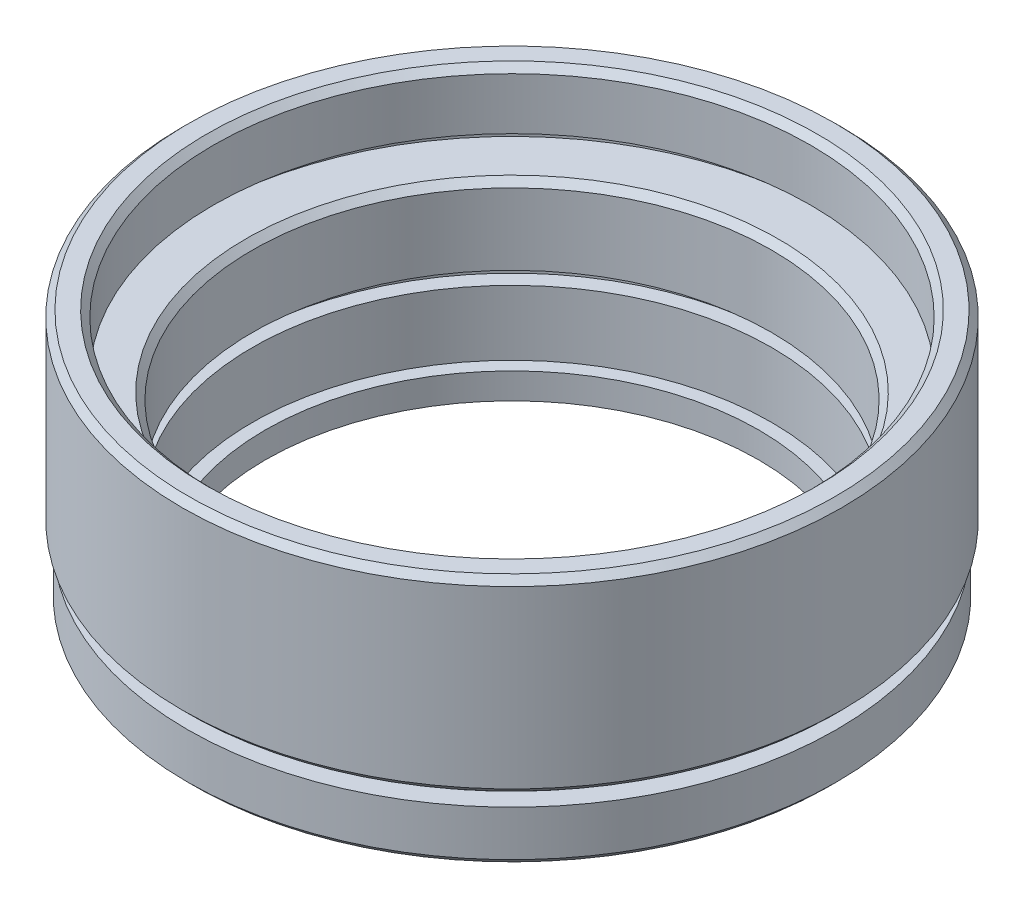
ISO-10303-21;
HEADER;
FILE_DESCRIPTION(('STEP AP214'),'2;1');
FILE_NAME('part.step','',(''),(''),'','','');
FILE_SCHEMA(('AUTOMOTIVE_DESIGN { 1 0 10303 214 1 1 1 1 }'));
ENDSEC;
DATA;
#1=APPLICATION_CONTEXT('core data for automotive mechanical design processes');
#2=APPLICATION_PROTOCOL_DEFINITION('international standard','automotive_design',2000,#1);
#3=PRODUCT_CONTEXT('',#1,'mechanical');
#4=PRODUCT('Part','Part','',(#3));
#5=PRODUCT_RELATED_PRODUCT_CATEGORY('part','',(#4));
#6=PRODUCT_DEFINITION_FORMATION('','',#4);
#7=PRODUCT_DEFINITION_CONTEXT('part definition',#1,'design');
#8=PRODUCT_DEFINITION('design','',#6,#7);
#9=PRODUCT_DEFINITION_SHAPE('','',#8);
#10=(LENGTH_UNIT() NAMED_UNIT(*) SI_UNIT(.MILLI.,.METRE.));
#11=(NAMED_UNIT(*) PLANE_ANGLE_UNIT() SI_UNIT($,.RADIAN.));
#12=(NAMED_UNIT(*) SI_UNIT($,.STERADIAN.) SOLID_ANGLE_UNIT());
#13=UNCERTAINTY_MEASURE_WITH_UNIT(LENGTH_MEASURE(1.E-05),#10,'distance_accuracy_value','');
#14=(GEOMETRIC_REPRESENTATION_CONTEXT(3) GLOBAL_UNCERTAINTY_ASSIGNED_CONTEXT((#13)) GLOBAL_UNIT_ASSIGNED_CONTEXT((#10,
#11,#12)) REPRESENTATION_CONTEXT('',''));
#15=CARTESIAN_POINT('',(0.,0.,0.));
#16=DIRECTION('',(0.,0.,1.));
#17=DIRECTION('',(1.,0.,0.));
#18=AXIS2_PLACEMENT_3D('',#15,#16,#17);
#19=CARTESIAN_POINT('',(23.,19.5,0.));
#20=DIRECTION('',(0.,1.,0.));
#21=DIRECTION('',(0.,0.,1.));
#22=AXIS2_PLACEMENT_3D('',#19,#20,#21);
#23=PLANE('',#22);
#24=CARTESIAN_POINT('',(0.,19.5,0.));
#25=DIRECTION('',(0.,1.,0.));
#26=DIRECTION('',(0.,0.,1.));
#27=AXIS2_PLACEMENT_3D('',#24,#25,#26);
#28=CIRCLE('',#27,23.5);
#29=CARTESIAN_POINT('',(0.,19.5,23.5));
#30=VERTEX_POINT('',#29);
#31=EDGE_CURVE('E40',#30,#30,#28,.F.);
#32=ORIENTED_EDGE('',*,*,#31,.T.);
#33=EDGE_LOOP('',(#32));
#34=FACE_BOUND('',#33,.T.);
#35=CARTESIAN_POINT('',(0.,19.5,0.));
#36=DIRECTION('',(0.,-1.,0.));
#37=DIRECTION('',(0.,0.,-1.));
#38=AXIS2_PLACEMENT_3D('',#35,#36,#37);
#39=CIRCLE('',#38,24.9);
#40=CARTESIAN_POINT('',(0.,19.5,-24.9));
#41=VERTEX_POINT('',#40);
#42=EDGE_CURVE('E107',#41,#41,#39,.T.);
#43=ORIENTED_EDGE('',*,*,#42,.F.);
#44=EDGE_LOOP('',(#43));
#45=FACE_BOUND('',#44,.T.);
#46=ADVANCED_FACE('F33',(#34,#45),#23,.T.);
#47=CARTESIAN_POINT('',(0.,0.,0.));
#48=DIRECTION('',(0.,-1.,0.));
#49=DIRECTION('',(0.,0.,-1.));
#50=AXIS2_PLACEMENT_3D('',#47,#48,#49);
#51=CYLINDRICAL_SURFACE('',#50,23.);
#52=CARTESIAN_POINT('',(0.,19.,0.));
#53=DIRECTION('',(0.,1.,0.));
#54=DIRECTION('',(0.,0.,1.));
#55=AXIS2_PLACEMENT_3D('',#52,#53,#54);
#56=CIRCLE('',#55,23.);
#57=CARTESIAN_POINT('',(0.,19.,23.));
#58=VERTEX_POINT('',#57);
#59=EDGE_CURVE('E10',#58,#58,#56,.T.);
#60=ORIENTED_EDGE('',*,*,#59,.T.);
#61=EDGE_LOOP('',(#60));
#62=FACE_BOUND('',#61,.T.);
#63=CARTESIAN_POINT('',(0.,15.,0.));
#64=DIRECTION('',(0.,-1.,0.));
#65=DIRECTION('',(0.,0.,-1.));
#66=AXIS2_PLACEMENT_3D('',#63,#64,#65);
#67=CIRCLE('',#66,23.);
#68=CARTESIAN_POINT('',(0.,15.,-23.));
#69=VERTEX_POINT('',#68);
#70=EDGE_CURVE('E53',#69,#69,#67,.T.);
#71=ORIENTED_EDGE('',*,*,#70,.T.);
#72=EDGE_LOOP('',(#71));
#73=FACE_BOUND('',#72,.T.);
#74=ADVANCED_FACE('F115',(#62,#73),#51,.F.);
#75=CARTESIAN_POINT('',(24.15,15.,0.));
#76=DIRECTION('',(0.,-1.,0.));
#77=DIRECTION('',(0.,0.,-1.));
#78=AXIS2_PLACEMENT_3D('',#75,#76,#77);
#79=PLANE('',#78);
#80=CARTESIAN_POINT('',(0.,15.,0.));
#81=DIRECTION('',(0.,-1.,0.));
#82=DIRECTION('',(0.,0.,-1.));
#83=AXIS2_PLACEMENT_3D('',#80,#81,#82);
#84=CIRCLE('',#83,24.15);
#85=CARTESIAN_POINT('',(0.,15.,-24.15));
#86=VERTEX_POINT('',#85);
#87=EDGE_CURVE('E56',#86,#86,#84,.T.);
#88=ORIENTED_EDGE('',*,*,#87,.T.);
#89=EDGE_LOOP('',(#88));
#90=FACE_BOUND('',#89,.T.);
#91=ORIENTED_EDGE('',*,*,#70,.F.);
#92=EDGE_LOOP('',(#91));
#93=FACE_BOUND('',#92,.T.);
#94=ADVANCED_FACE('F120',(#90,#93),#79,.T.);
#95=CARTESIAN_POINT('',(0.,0.,0.));
#96=DIRECTION('',(0.,-1.,0.));
#97=DIRECTION('',(0.,0.,-1.));
#98=AXIS2_PLACEMENT_3D('',#95,#96,#97);
#99=CYLINDRICAL_SURFACE('',#98,24.15);
#100=CARTESIAN_POINT('',(0.,14.,0.));
#101=DIRECTION('',(0.,-1.,0.));
#102=DIRECTION('',(0.,0.,-1.));
#103=AXIS2_PLACEMENT_3D('',#100,#101,#102);
#104=CIRCLE('',#103,24.15);
#105=CARTESIAN_POINT('',(0.,14.,-24.15));
#106=VERTEX_POINT('',#105);
#107=EDGE_CURVE('E59',#106,#106,#104,.T.);
#108=ORIENTED_EDGE('',*,*,#107,.T.);
#109=EDGE_LOOP('',(#108));
#110=FACE_BOUND('',#109,.T.);
#111=ORIENTED_EDGE('',*,*,#87,.F.);
#112=EDGE_LOOP('',(#111));
#113=FACE_BOUND('',#112,.T.);
#114=ADVANCED_FACE('F141',(#110,#113),#99,.F.);
#115=CARTESIAN_POINT('',(20.,14.,0.));
#116=DIRECTION('',(0.,1.,0.));
#117=DIRECTION('',(0.,0.,1.));
#118=AXIS2_PLACEMENT_3D('',#115,#116,#117);
#119=PLANE('',#118);
#120=CARTESIAN_POINT('',(0.,14.,0.));
#121=DIRECTION('',(0.,1.,0.));
#122=DIRECTION('',(0.,0.,1.));
#123=AXIS2_PLACEMENT_3D('',#120,#121,#122);
#124=CIRCLE('',#123,20.5);
#125=CARTESIAN_POINT('',(0.,14.,20.5));
#126=VERTEX_POINT('',#125);
#127=EDGE_CURVE('E48',#126,#126,#124,.F.);
#128=ORIENTED_EDGE('',*,*,#127,.T.);
#129=EDGE_LOOP('',(#128));
#130=FACE_BOUND('',#129,.T.);
#131=ORIENTED_EDGE('',*,*,#107,.F.);
#132=EDGE_LOOP('',(#131));
#133=FACE_BOUND('',#132,.T.);
#134=ADVANCED_FACE('F137',(#130,#133),#119,.T.);
#135=CARTESIAN_POINT('',(0.,0.,0.));
#136=DIRECTION('',(0.,-1.,0.));
#137=DIRECTION('',(0.,0.,-1.));
#138=AXIS2_PLACEMENT_3D('',#135,#136,#137);
#139=CYLINDRICAL_SURFACE('',#138,20.);
#140=CARTESIAN_POINT('',(0.,13.5,0.));
#141=DIRECTION('',(0.,1.,0.));
#142=DIRECTION('',(0.,0.,1.));
#143=AXIS2_PLACEMENT_3D('',#140,#141,#142);
#144=CIRCLE('',#143,20.);
#145=CARTESIAN_POINT('',(0.,13.5,20.));
#146=VERTEX_POINT('',#145);
#147=EDGE_CURVE('E44',#146,#146,#144,.T.);
#148=ORIENTED_EDGE('',*,*,#147,.T.);
#149=EDGE_LOOP('',(#148));
#150=FACE_BOUND('',#149,.T.);
#151=CARTESIAN_POINT('',(0.,8.,0.));
#152=DIRECTION('',(0.,-1.,0.));
#153=DIRECTION('',(0.,0.,-1.));
#154=AXIS2_PLACEMENT_3D('',#151,#152,#153);
#155=CIRCLE('',#154,20.);
#156=CARTESIAN_POINT('',(0.,8.,-20.));
#157=VERTEX_POINT('',#156);
#158=EDGE_CURVE('E62',#157,#157,#155,.T.);
#159=ORIENTED_EDGE('',*,*,#158,.T.);
#160=EDGE_LOOP('',(#159));
#161=FACE_BOUND('',#160,.T.);
#162=ADVANCED_FACE('F140',(#150,#161),#139,.F.);
#163=CARTESIAN_POINT('',(21.15,8.,0.));
#164=DIRECTION('',(0.,-1.,0.));
#165=DIRECTION('',(0.,0.,-1.));
#166=AXIS2_PLACEMENT_3D('',#163,#164,#165);
#167=PLANE('',#166);
#168=CARTESIAN_POINT('',(0.,8.,0.));
#169=DIRECTION('',(0.,-1.,0.));
#170=DIRECTION('',(0.,0.,-1.));
#171=AXIS2_PLACEMENT_3D('',#168,#169,#170);
#172=CIRCLE('',#171,21.15);
#173=CARTESIAN_POINT('',(0.,8.,-21.15));
#174=VERTEX_POINT('',#173);
#175=EDGE_CURVE('E65',#174,#174,#172,.T.);
#176=ORIENTED_EDGE('',*,*,#175,.T.);
#177=EDGE_LOOP('',(#176));
#178=FACE_BOUND('',#177,.T.);
#179=ORIENTED_EDGE('',*,*,#158,.F.);
#180=EDGE_LOOP('',(#179));
#181=FACE_BOUND('',#180,.T.);
#182=ADVANCED_FACE('F159',(#178,#181),#167,.T.);
#183=CARTESIAN_POINT('',(0.,0.,0.));
#184=DIRECTION('',(0.,-1.,0.));
#185=DIRECTION('',(0.,0.,-1.));
#186=AXIS2_PLACEMENT_3D('',#183,#184,#185);
#187=CYLINDRICAL_SURFACE('',#186,21.15);
#188=CARTESIAN_POINT('',(0.,7.,0.));
#189=DIRECTION('',(0.,-1.,0.));
#190=DIRECTION('',(0.,0.,-1.));
#191=AXIS2_PLACEMENT_3D('',#188,#189,#190);
#192=CIRCLE('',#191,21.15);
#193=CARTESIAN_POINT('',(0.,7.,-21.15));
#194=VERTEX_POINT('',#193);
#195=EDGE_CURVE('E68',#194,#194,#192,.T.);
#196=ORIENTED_EDGE('',*,*,#195,.T.);
#197=EDGE_LOOP('',(#196));
#198=FACE_BOUND('',#197,.T.);
#199=ORIENTED_EDGE('',*,*,#175,.F.);
#200=EDGE_LOOP('',(#199));
#201=FACE_BOUND('',#200,.T.);
#202=ADVANCED_FACE('F163',(#198,#201),#187,.F.);
#203=CARTESIAN_POINT('',(20.,7.,0.));
#204=DIRECTION('',(0.,1.,0.));
#205=DIRECTION('',(0.,0.,1.));
#206=AXIS2_PLACEMENT_3D('',#203,#204,#205);
#207=PLANE('',#206);
#208=CARTESIAN_POINT('',(0.,7.,0.));
#209=DIRECTION('',(0.,-1.,0.));
#210=DIRECTION('',(0.,0.,-1.));
#211=AXIS2_PLACEMENT_3D('',#208,#209,#210);
#212=CIRCLE('',#211,20.);
#213=CARTESIAN_POINT('',(0.,7.,-20.));
#214=VERTEX_POINT('',#213);
#215=EDGE_CURVE('E71',#214,#214,#212,.T.);
#216=ORIENTED_EDGE('',*,*,#215,.T.);
#217=EDGE_LOOP('',(#216));
#218=FACE_BOUND('',#217,.T.);
#219=ORIENTED_EDGE('',*,*,#195,.F.);
#220=EDGE_LOOP('',(#219));
#221=FACE_BOUND('',#220,.T.);
#222=ADVANCED_FACE('F167',(#218,#221),#207,.T.);
#223=CARTESIAN_POINT('',(0.,0.,0.));
#224=DIRECTION('',(0.,-1.,0.));
#225=DIRECTION('',(0.,0.,-1.));
#226=AXIS2_PLACEMENT_3D('',#223,#224,#225);
#227=CYLINDRICAL_SURFACE('',#226,20.);
#228=CARTESIAN_POINT('',(0.,2.,0.));
#229=DIRECTION('',(0.,-1.,0.));
#230=DIRECTION('',(0.,0.,-1.));
#231=AXIS2_PLACEMENT_3D('',#228,#229,#230);
#232=CIRCLE('',#231,20.);
#233=CARTESIAN_POINT('',(0.,2.,-20.));
#234=VERTEX_POINT('',#233);
#235=EDGE_CURVE('E74',#234,#234,#232,.T.);
#236=ORIENTED_EDGE('',*,*,#235,.T.);
#237=EDGE_LOOP('',(#236));
#238=FACE_BOUND('',#237,.T.);
#239=ORIENTED_EDGE('',*,*,#215,.F.);
#240=EDGE_LOOP('',(#239));
#241=FACE_BOUND('',#240,.T.);
#242=ADVANCED_FACE('F171',(#238,#241),#227,.F.);
#243=CARTESIAN_POINT('',(19.,2.,0.));
#244=DIRECTION('',(0.,1.,0.));
#245=DIRECTION('',(0.,0.,1.));
#246=AXIS2_PLACEMENT_3D('',#243,#244,#245);
#247=PLANE('',#246);
#248=CARTESIAN_POINT('',(0.,2.,0.));
#249=DIRECTION('',(0.,-1.,0.));
#250=DIRECTION('',(0.,0.,-1.));
#251=AXIS2_PLACEMENT_3D('',#248,#249,#250);
#252=CIRCLE('',#251,19.);
#253=CARTESIAN_POINT('',(0.,2.,-19.));
#254=VERTEX_POINT('',#253);
#255=EDGE_CURVE('E77',#254,#254,#252,.T.);
#256=ORIENTED_EDGE('',*,*,#255,.T.);
#257=EDGE_LOOP('',(#256));
#258=FACE_BOUND('',#257,.T.);
#259=ORIENTED_EDGE('',*,*,#235,.F.);
#260=EDGE_LOOP('',(#259));
#261=FACE_BOUND('',#260,.T.);
#262=ADVANCED_FACE('F175',(#258,#261),#247,.T.);
#263=CARTESIAN_POINT('',(0.,0.,0.));
#264=DIRECTION('',(0.,-1.,0.));
#265=DIRECTION('',(0.,0.,-1.));
#266=AXIS2_PLACEMENT_3D('',#263,#264,#265);
#267=CYLINDRICAL_SURFACE('',#266,19.);
#268=CARTESIAN_POINT('',(0.,0.,0.));
#269=DIRECTION('',(0.,-1.,0.));
#270=DIRECTION('',(0.,0.,-1.));
#271=AXIS2_PLACEMENT_3D('',#268,#269,#270);
#272=CIRCLE('',#271,19.);
#273=CARTESIAN_POINT('',(0.,0.,-19.));
#274=VERTEX_POINT('',#273);
#275=EDGE_CURVE('E80',#274,#274,#272,.T.);
#276=ORIENTED_EDGE('',*,*,#275,.T.);
#277=EDGE_LOOP('',(#276));
#278=FACE_BOUND('',#277,.T.);
#279=ORIENTED_EDGE('',*,*,#255,.F.);
#280=EDGE_LOOP('',(#279));
#281=FACE_BOUND('',#280,.T.);
#282=ADVANCED_FACE('F179',(#278,#281),#267,.F.);
#283=CARTESIAN_POINT('',(19.,0.,0.));
#284=DIRECTION('',(0.,-1.,0.));
#285=DIRECTION('',(0.,0.,-1.));
#286=AXIS2_PLACEMENT_3D('',#283,#284,#285);
#287=PLANE('',#286);
#288=CARTESIAN_POINT('',(0.,0.,0.));
#289=DIRECTION('',(0.,-1.,0.));
#290=DIRECTION('',(0.,0.,-1.));
#291=AXIS2_PLACEMENT_3D('',#288,#289,#290);
#292=CIRCLE('',#291,24.5);
#293=CARTESIAN_POINT('',(0.,0.,-24.5));
#294=VERTEX_POINT('',#293);
#295=EDGE_CURVE('E83',#294,#294,#292,.T.);
#296=ORIENTED_EDGE('',*,*,#295,.T.);
#297=EDGE_LOOP('',(#296));
#298=FACE_BOUND('',#297,.T.);
#299=ORIENTED_EDGE('',*,*,#275,.F.);
#300=EDGE_LOOP('',(#299));
#301=FACE_BOUND('',#300,.T.);
#302=ADVANCED_FACE('F183',(#298,#301),#287,.T.);
#303=CARTESIAN_POINT('',(0.,0.,0.));
#304=DIRECTION('',(0.,1.,0.));
#305=DIRECTION('',(0.,0.,1.));
#306=AXIS2_PLACEMENT_3D('',#303,#304,#305);
#307=CONICAL_SURFACE('',#306,24.5,0.785398163397451);
#308=CARTESIAN_POINT('',(0.,0.499999999999998,0.));
#309=DIRECTION('',(0.,-1.,0.));
#310=DIRECTION('',(0.,0.,-1.));
#311=AXIS2_PLACEMENT_3D('',#308,#309,#310);
#312=CIRCLE('',#311,25.);
#313=CARTESIAN_POINT('',(0.,0.499999999999998,-25.));
#314=VERTEX_POINT('',#313);
#315=EDGE_CURVE('E86',#314,#314,#312,.T.);
#316=ORIENTED_EDGE('',*,*,#315,.T.);
#317=EDGE_LOOP('',(#316));
#318=FACE_BOUND('',#317,.T.);
#319=ORIENTED_EDGE('',*,*,#295,.F.);
#320=EDGE_LOOP('',(#319));
#321=FACE_BOUND('',#320,.T.);
#322=ADVANCED_FACE('F187',(#318,#321),#307,.T.);
#323=CARTESIAN_POINT('',(0.,0.,0.));
#324=DIRECTION('',(0.,-1.,0.));
#325=DIRECTION('',(0.,0.,-1.));
#326=AXIS2_PLACEMENT_3D('',#323,#324,#325);
#327=CYLINDRICAL_SURFACE('',#326,25.);
#328=CARTESIAN_POINT('',(0.,4.,0.));
#329=DIRECTION('',(0.,-1.,0.));
#330=DIRECTION('',(0.,0.,-1.));
#331=AXIS2_PLACEMENT_3D('',#328,#329,#330);
#332=CIRCLE('',#331,25.);
#333=CARTESIAN_POINT('',(0.,4.,-25.));
#334=VERTEX_POINT('',#333);
#335=EDGE_CURVE('E89',#334,#334,#332,.T.);
#336=ORIENTED_EDGE('',*,*,#335,.T.);
#337=EDGE_LOOP('',(#336));
#338=FACE_BOUND('',#337,.T.);
#339=ORIENTED_EDGE('',*,*,#315,.F.);
#340=EDGE_LOOP('',(#339));
#341=FACE_BOUND('',#340,.T.);
#342=ADVANCED_FACE('F191',(#338,#341),#327,.T.);
#343=CARTESIAN_POINT('',(25.,4.,0.));
#344=DIRECTION('',(0.,1.,0.));
#345=DIRECTION('',(0.,0.,1.));
#346=AXIS2_PLACEMENT_3D('',#343,#344,#345);
#347=PLANE('',#346);
#348=CARTESIAN_POINT('',(0.,4.,0.));
#349=DIRECTION('',(0.,-1.,0.));
#350=DIRECTION('',(0.,0.,-1.));
#351=AXIS2_PLACEMENT_3D('',#348,#349,#350);
#352=CIRCLE('',#351,23.5);
#353=CARTESIAN_POINT('',(0.,4.,-23.5));
#354=VERTEX_POINT('',#353);
#355=EDGE_CURVE('E92',#354,#354,#352,.T.);
#356=ORIENTED_EDGE('',*,*,#355,.T.);
#357=EDGE_LOOP('',(#356));
#358=FACE_BOUND('',#357,.T.);
#359=ORIENTED_EDGE('',*,*,#335,.F.);
#360=EDGE_LOOP('',(#359));
#361=FACE_BOUND('',#360,.T.);
#362=ADVANCED_FACE('F195',(#358,#361),#347,.T.);
#363=CARTESIAN_POINT('',(0.,0.,0.));
#364=DIRECTION('',(0.,-1.,0.));
#365=DIRECTION('',(0.,0.,-1.));
#366=AXIS2_PLACEMENT_3D('',#363,#364,#365);
#367=CYLINDRICAL_SURFACE('',#366,23.5);
#368=CARTESIAN_POINT('',(0.,5.,0.));
#369=DIRECTION('',(0.,-1.,0.));
#370=DIRECTION('',(0.,0.,-1.));
#371=AXIS2_PLACEMENT_3D('',#368,#369,#370);
#372=CIRCLE('',#371,23.5);
#373=CARTESIAN_POINT('',(0.,5.,-23.5));
#374=VERTEX_POINT('',#373);
#375=EDGE_CURVE('E95',#374,#374,#372,.T.);
#376=ORIENTED_EDGE('',*,*,#375,.T.);
#377=EDGE_LOOP('',(#376));
#378=FACE_BOUND('',#377,.T.);
#379=ORIENTED_EDGE('',*,*,#355,.F.);
#380=EDGE_LOOP('',(#379));
#381=FACE_BOUND('',#380,.T.);
#382=ADVANCED_FACE('F199',(#378,#381),#367,.T.);
#383=CARTESIAN_POINT('',(23.5,5.,0.));
#384=DIRECTION('',(0.,-1.,0.));
#385=DIRECTION('',(0.,0.,-1.));
#386=AXIS2_PLACEMENT_3D('',#383,#384,#385);
#387=PLANE('',#386);
#388=CARTESIAN_POINT('',(0.,5.,0.));
#389=DIRECTION('',(0.,-1.,0.));
#390=DIRECTION('',(0.,0.,-1.));
#391=AXIS2_PLACEMENT_3D('',#388,#389,#390);
#392=CIRCLE('',#391,24.9);
#393=CARTESIAN_POINT('',(0.,5.,-24.9));
#394=VERTEX_POINT('',#393);
#395=EDGE_CURVE('E98',#394,#394,#392,.T.);
#396=ORIENTED_EDGE('',*,*,#395,.T.);
#397=EDGE_LOOP('',(#396));
#398=FACE_BOUND('',#397,.T.);
#399=ORIENTED_EDGE('',*,*,#375,.F.);
#400=EDGE_LOOP('',(#399));
#401=FACE_BOUND('',#400,.T.);
#402=ADVANCED_FACE('F203',(#398,#401),#387,.T.);
#403=CARTESIAN_POINT('',(0.,5.,0.));
#404=DIRECTION('',(0.,1.,0.));
#405=DIRECTION('',(0.,0.,1.));
#406=AXIS2_PLACEMENT_3D('',#403,#404,#405);
#407=CONICAL_SURFACE('',#406,24.9,0.785398163397451);
#408=CARTESIAN_POINT('',(0.,5.5,0.));
#409=DIRECTION('',(0.,-1.,0.));
#410=DIRECTION('',(0.,0.,-1.));
#411=AXIS2_PLACEMENT_3D('',#408,#409,#410);
#412=CIRCLE('',#411,25.4);
#413=CARTESIAN_POINT('',(0.,5.5,-25.4));
#414=VERTEX_POINT('',#413);
#415=EDGE_CURVE('E101',#414,#414,#412,.T.);
#416=ORIENTED_EDGE('',*,*,#415,.T.);
#417=EDGE_LOOP('',(#416));
#418=FACE_BOUND('',#417,.T.);
#419=ORIENTED_EDGE('',*,*,#395,.F.);
#420=EDGE_LOOP('',(#419));
#421=FACE_BOUND('',#420,.T.);
#422=ADVANCED_FACE('F207',(#418,#421),#407,.T.);
#423=CARTESIAN_POINT('',(0.,0.,0.));
#424=DIRECTION('',(0.,-1.,0.));
#425=DIRECTION('',(0.,0.,-1.));
#426=AXIS2_PLACEMENT_3D('',#423,#424,#425);
#427=CYLINDRICAL_SURFACE('',#426,25.4);
#428=CARTESIAN_POINT('',(0.,19.,0.));
#429=DIRECTION('',(0.,-1.,0.));
#430=DIRECTION('',(0.,0.,-1.));
#431=AXIS2_PLACEMENT_3D('',#428,#429,#430);
#432=CIRCLE('',#431,25.4);
#433=CARTESIAN_POINT('',(0.,19.,-25.4));
#434=VERTEX_POINT('',#433);
#435=EDGE_CURVE('E104',#434,#434,#432,.T.);
#436=ORIENTED_EDGE('',*,*,#435,.T.);
#437=EDGE_LOOP('',(#436));
#438=FACE_BOUND('',#437,.T.);
#439=ORIENTED_EDGE('',*,*,#415,.F.);
#440=EDGE_LOOP('',(#439));
#441=FACE_BOUND('',#440,.T.);
#442=ADVANCED_FACE('F131',(#438,#441),#427,.T.);
#443=CARTESIAN_POINT('',(0.,19.,0.));
#444=DIRECTION('',(0.,-1.,0.));
#445=DIRECTION('',(0.,0.,-1.));
#446=AXIS2_PLACEMENT_3D('',#443,#444,#445);
#447=CONICAL_SURFACE('',#446,25.4,0.785398163397445);
#448=ORIENTED_EDGE('',*,*,#42,.T.);
#449=EDGE_LOOP('',(#448));
#450=FACE_BOUND('',#449,.T.);
#451=ORIENTED_EDGE('',*,*,#435,.F.);
#452=EDGE_LOOP('',(#451));
#453=FACE_BOUND('',#452,.T.);
#454=ADVANCED_FACE('F111',(#450,#453),#447,.T.);
#455=CARTESIAN_POINT('',(0.,14.,0.));
#456=DIRECTION('',(0.,1.,0.));
#457=DIRECTION('',(0.,0.,1.));
#458=AXIS2_PLACEMENT_3D('',#455,#456,#457);
#459=CONICAL_SURFACE('',#458,20.5,0.785398163397441);
#460=ORIENTED_EDGE('',*,*,#147,.F.);
#461=EDGE_LOOP('',(#460));
#462=FACE_BOUND('',#461,.T.);
#463=ORIENTED_EDGE('',*,*,#127,.F.);
#464=EDGE_LOOP('',(#463));
#465=FACE_BOUND('',#464,.T.);
#466=ADVANCED_FACE('F123',(#462,#465),#459,.F.);
#467=CARTESIAN_POINT('',(0.,19.5,0.));
#468=DIRECTION('',(0.,1.,0.));
#469=DIRECTION('',(0.,0.,1.));
#470=AXIS2_PLACEMENT_3D('',#467,#468,#469);
#471=CONICAL_SURFACE('',#470,23.5,0.785398163397448);
#472=ORIENTED_EDGE('',*,*,#59,.F.);
#473=EDGE_LOOP('',(#472));
#474=FACE_BOUND('',#473,.T.);
#475=ORIENTED_EDGE('',*,*,#31,.F.);
#476=EDGE_LOOP('',(#475));
#477=FACE_BOUND('',#476,.T.);
#478=ADVANCED_FACE('F35',(#474,#477),#471,.F.);
#479=CLOSED_SHELL('',(#46,#74,#94,#114,#134,#162,#182,#202,#222,#242,#262,#282,#302,#322,#342,
#362,#382,#402,#422,#442,#454,#466,#478));
#480=MANIFOLD_SOLID_BREP('B2',#479);
#481=ADVANCED_BREP_SHAPE_REPRESENTATION('',(#18,#480),#14);
#482=SHAPE_DEFINITION_REPRESENTATION(#9,#481);
ENDSEC;
END-ISO-10303-21;
